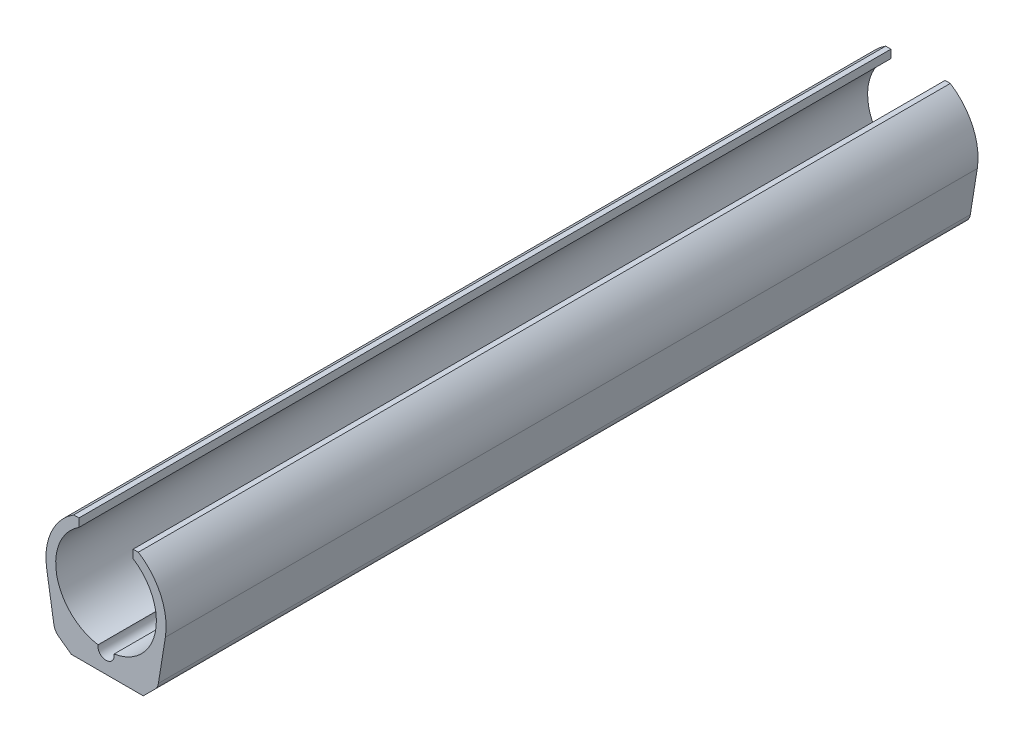
ISO-10303-21;
HEADER;
FILE_DESCRIPTION(('STEP AP214'),'2;1');
FILE_NAME('part.step','',(''),(''),'','','');
FILE_SCHEMA(('AUTOMOTIVE_DESIGN { 1 0 10303 214 1 1 1 1 }'));
ENDSEC;
DATA;
#1=APPLICATION_CONTEXT('core data for automotive mechanical design processes');
#2=APPLICATION_PROTOCOL_DEFINITION('international standard','automotive_design',2000,#1);
#3=PRODUCT_CONTEXT('',#1,'mechanical');
#4=PRODUCT('Part','Part','',(#3));
#5=PRODUCT_RELATED_PRODUCT_CATEGORY('part','',(#4));
#6=PRODUCT_DEFINITION_FORMATION('','',#4);
#7=PRODUCT_DEFINITION_CONTEXT('part definition',#1,'design');
#8=PRODUCT_DEFINITION('design','',#6,#7);
#9=PRODUCT_DEFINITION_SHAPE('','',#8);
#10=(LENGTH_UNIT() NAMED_UNIT(*) SI_UNIT(.MILLI.,.METRE.));
#11=(NAMED_UNIT(*) PLANE_ANGLE_UNIT() SI_UNIT($,.RADIAN.));
#12=(NAMED_UNIT(*) SI_UNIT($,.STERADIAN.) SOLID_ANGLE_UNIT());
#13=UNCERTAINTY_MEASURE_WITH_UNIT(LENGTH_MEASURE(1.E-05),#10,'distance_accuracy_value','');
#14=(GEOMETRIC_REPRESENTATION_CONTEXT(3) GLOBAL_UNCERTAINTY_ASSIGNED_CONTEXT((#13)) GLOBAL_UNIT_ASSIGNED_CONTEXT((#10,
#11,#12)) REPRESENTATION_CONTEXT('',''));
#15=CARTESIAN_POINT('',(0.,0.,0.));
#16=DIRECTION('',(0.,0.,1.));
#17=DIRECTION('',(1.,0.,0.));
#18=AXIS2_PLACEMENT_3D('',#15,#16,#17);
#19=CARTESIAN_POINT('',(0.,0.,200.));
#20=DIRECTION('',(0.,0.,-1.));
#21=DIRECTION('',(-1.,0.,0.));
#22=AXIS2_PLACEMENT_3D('',#19,#20,#21);
#23=CYLINDRICAL_SURFACE('',#22,14.8);
#24=CARTESIAN_POINT('',(0.,0.,0.));
#25=DIRECTION('',(0.,0.,1.));
#26=DIRECTION('',(1.,0.,0.));
#27=AXIS2_PLACEMENT_3D('',#24,#25,#26);
#28=CIRCLE('',#27,14.8);
#29=CARTESIAN_POINT('',(-7.96038271843621,12.4768708807947,0.));
#30=VERTEX_POINT('',#29);
#31=CARTESIAN_POINT('',(-14.6132639065058,-2.34361216902767,0.));
#32=VERTEX_POINT('',#31);
#33=EDGE_CURVE('E167',#30,#32,#28,.T.);
#34=ORIENTED_EDGE('',*,*,#33,.T.);
#35=DIRECTION('',(0.,0.,-1.));
#36=VECTOR('',#35,1.);
#37=CARTESIAN_POINT('',(-14.6132639065058,-2.34361216902767,200.));
#38=LINE('',#37,#36);
#39=CARTESIAN_POINT('',(-14.6132639065058,-2.34361216902767,200.));
#40=VERTEX_POINT('',#39);
#41=EDGE_CURVE('E151',#40,#32,#38,.T.);
#42=ORIENTED_EDGE('',*,*,#41,.F.);
#43=CARTESIAN_POINT('',(0.,0.,200.));
#44=DIRECTION('',(0.,0.,1.));
#45=DIRECTION('',(1.,0.,0.));
#46=AXIS2_PLACEMENT_3D('',#43,#44,#45);
#47=CIRCLE('',#46,14.8);
#48=CARTESIAN_POINT('',(-7.96038271843621,12.4768708807947,200.));
#49=VERTEX_POINT('',#48);
#50=EDGE_CURVE('E154',#49,#40,#47,.T.);
#51=ORIENTED_EDGE('',*,*,#50,.F.);
#52=DIRECTION('',(0.,0.,-1.));
#53=VECTOR('',#52,1.);
#54=CARTESIAN_POINT('',(-7.96038271843621,12.4768708807947,200.));
#55=LINE('',#54,#53);
#56=EDGE_CURVE('E247',#49,#30,#55,.T.);
#57=ORIENTED_EDGE('',*,*,#56,.T.);
#58=EDGE_LOOP('',(#34,#42,#51,#57));
#59=FACE_BOUND('',#58,.T.);
#60=ADVANCED_FACE('F35',(#59),#23,.T.);
#61=CARTESIAN_POINT('',(-14.6132639065058,-2.34361216902767,200.));
#62=DIRECTION('',(0.987382696385528,0.158352173582951,0.));
#63=DIRECTION('',(-0.158352173582951,0.987382696385528,0.));
#64=AXIS2_PLACEMENT_3D('',#61,#62,#63);
#65=PLANE('',#64);
#66=DIRECTION('',(0.158352173582951,-0.987382696385528,0.));
#67=VECTOR('',#66,1.);
#68=CARTESIAN_POINT('',(-14.6132639065058,-2.34361216902767,0.));
#69=LINE('',#68,#67);
#70=CARTESIAN_POINT('',(-12.8430114109721,-13.381772509831,0.));
#71=VERTEX_POINT('',#70);
#72=EDGE_CURVE('E249',#32,#71,#69,.T.);
#73=ORIENTED_EDGE('',*,*,#72,.T.);
#74=DIRECTION('',(0.,0.,-1.));
#75=VECTOR('',#74,1.);
#76=CARTESIAN_POINT('',(-12.8430114109721,-13.381772509831,200.));
#77=LINE('',#76,#75);
#78=CARTESIAN_POINT('',(-12.8430114109721,-13.381772509831,200.));
#79=VERTEX_POINT('',#78);
#80=EDGE_CURVE('E43',#71,#79,#77,.F.);
#81=ORIENTED_EDGE('',*,*,#80,.T.);
#82=DIRECTION('',(0.158352173582951,-0.987382696385528,0.));
#83=VECTOR('',#82,1.);
#84=CARTESIAN_POINT('',(-14.6132639065058,-2.34361216902767,200.));
#85=LINE('',#84,#83);
#86=EDGE_CURVE('E146',#40,#79,#85,.T.);
#87=ORIENTED_EDGE('',*,*,#86,.F.);
#88=ORIENTED_EDGE('',*,*,#41,.T.);
#89=EDGE_LOOP('',(#73,#81,#87,#88));
#90=FACE_BOUND('',#89,.T.);
#91=ADVANCED_FACE('F149',(#90),#65,.F.);
#92=CARTESIAN_POINT('',(-12.1711800364353,-17.5708825112737,200.));
#93=DIRECTION('',(0.,1.,0.));
#94=DIRECTION('',(0.,0.,1.));
#95=AXIS2_PLACEMENT_3D('',#92,#93,#94);
#96=PLANE('',#95);
#97=DIRECTION('',(1.,0.,0.));
#98=VECTOR('',#97,1.);
#99=CARTESIAN_POINT('',(-12.1711800364353,-17.5708825112737,0.));
#100=LINE('',#99,#98);
#101=CARTESIAN_POINT('',(-8.55249541930159,-17.5708825112737,0.));
#102=VERTEX_POINT('',#101);
#103=CARTESIAN_POINT('',(9.17118003643525,-17.5708825112737,0.));
#104=VERTEX_POINT('',#103);
#105=EDGE_CURVE('E230',#102,#104,#100,.T.);
#106=ORIENTED_EDGE('',*,*,#105,.T.);
#107=DIRECTION('',(0.,0.,1.));
#108=VECTOR('',#107,1.);
#109=CARTESIAN_POINT('',(9.17118003643525,-17.5708825112737,200.));
#110=LINE('',#109,#108);
#111=CARTESIAN_POINT('',(9.17118003643525,-17.5708825112737,200.));
#112=VERTEX_POINT('',#111);
#113=EDGE_CURVE('E183',#104,#112,#110,.T.);
#114=ORIENTED_EDGE('',*,*,#113,.T.);
#115=DIRECTION('',(1.,0.,0.));
#116=VECTOR('',#115,1.);
#117=CARTESIAN_POINT('',(-12.1711800364353,-17.5708825112737,200.));
#118=LINE('',#117,#116);
#119=CARTESIAN_POINT('',(-8.55249541930159,-17.5708825112737,200.));
#120=VERTEX_POINT('',#119);
#121=EDGE_CURVE('E153',#120,#112,#118,.T.);
#122=ORIENTED_EDGE('',*,*,#121,.F.);
#123=DIRECTION('',(0.,0.,-1.));
#124=VECTOR('',#123,1.);
#125=CARTESIAN_POINT('',(-8.55249541930159,-17.5708825112737,200.));
#126=LINE('',#125,#124);
#127=EDGE_CURVE('E180',#120,#102,#126,.T.);
#128=ORIENTED_EDGE('',*,*,#127,.T.);
#129=EDGE_LOOP('',(#106,#114,#122,#128));
#130=FACE_BOUND('',#129,.T.);
#131=ADVANCED_FACE('F228',(#130),#96,.F.);
#132=CARTESIAN_POINT('',(14.6132639065058,-2.34361216902767,200.));
#133=DIRECTION('',(-0.987382696385528,0.158352173582951,0.));
#134=DIRECTION('',(-0.158352173582951,-0.987382696385528,0.));
#135=AXIS2_PLACEMENT_3D('',#132,#133,#134);
#136=PLANE('',#135);
#137=DIRECTION('',(0.158352173582951,0.987382696385528,0.));
#138=VECTOR('',#137,1.);
#139=CARTESIAN_POINT('',(14.6132639065058,-2.34361216902767,200.));
#140=LINE('',#139,#138);
#141=CARTESIAN_POINT('',(12.8980520365405,-13.0385744339547,200.));
#142=VERTEX_POINT('',#141);
#143=CARTESIAN_POINT('',(14.6132639065058,-2.34361216902767,200.));
#144=VERTEX_POINT('',#143);
#145=EDGE_CURVE('E202',#142,#144,#140,.T.);
#146=ORIENTED_EDGE('',*,*,#145,.F.);
#147=DIRECTION('',(0.,0.,1.));
#148=VECTOR('',#147,1.);
#149=CARTESIAN_POINT('',(12.8980520365405,-13.0385744339547,0.));
#150=LINE('',#149,#148);
#151=CARTESIAN_POINT('',(12.8980520365405,-13.0385744339547,0.));
#152=VERTEX_POINT('',#151);
#153=EDGE_CURVE('E189',#142,#152,#150,.F.);
#154=ORIENTED_EDGE('',*,*,#153,.T.);
#155=DIRECTION('',(0.158352173582951,0.987382696385528,0.));
#156=VECTOR('',#155,1.);
#157=CARTESIAN_POINT('',(14.6132639065058,-2.34361216902767,0.));
#158=LINE('',#157,#156);
#159=CARTESIAN_POINT('',(14.6132639065058,-2.34361216902767,0.));
#160=VERTEX_POINT('',#159);
#161=EDGE_CURVE('E222',#152,#160,#158,.T.);
#162=ORIENTED_EDGE('',*,*,#161,.T.);
#163=DIRECTION('',(0.,0.,-1.));
#164=VECTOR('',#163,1.);
#165=CARTESIAN_POINT('',(14.6132639065058,-2.34361216902767,200.));
#166=LINE('',#165,#164);
#167=EDGE_CURVE('E169',#144,#160,#166,.T.);
#168=ORIENTED_EDGE('',*,*,#167,.F.);
#169=EDGE_LOOP('',(#146,#154,#162,#168));
#170=FACE_BOUND('',#169,.T.);
#171=ADVANCED_FACE('F210',(#170),#136,.F.);
#172=CARTESIAN_POINT('',(0.,0.,200.));
#173=DIRECTION('',(0.,0.,-1.));
#174=DIRECTION('',(-1.,0.,0.));
#175=AXIS2_PLACEMENT_3D('',#172,#173,#174);
#176=CYLINDRICAL_SURFACE('',#175,14.8);
#177=CARTESIAN_POINT('',(0.,0.,0.));
#178=DIRECTION('',(0.,0.,1.));
#179=DIRECTION('',(1.,0.,0.));
#180=AXIS2_PLACEMENT_3D('',#177,#178,#179);
#181=CIRCLE('',#180,14.8);
#182=CARTESIAN_POINT('',(7.96038271843621,12.4768708807947,0.));
#183=VERTEX_POINT('',#182);
#184=EDGE_CURVE('E253',#160,#183,#181,.T.);
#185=ORIENTED_EDGE('',*,*,#184,.T.);
#186=DIRECTION('',(0.,0.,-1.));
#187=VECTOR('',#186,1.);
#188=CARTESIAN_POINT('',(7.96038271843621,12.4768708807947,200.));
#189=LINE('',#188,#187);
#190=CARTESIAN_POINT('',(7.96038271843621,12.4768708807947,200.));
#191=VERTEX_POINT('',#190);
#192=EDGE_CURVE('E175',#191,#183,#189,.T.);
#193=ORIENTED_EDGE('',*,*,#192,.F.);
#194=CARTESIAN_POINT('',(0.,0.,200.));
#195=DIRECTION('',(0.,0.,1.));
#196=DIRECTION('',(1.,0.,0.));
#197=AXIS2_PLACEMENT_3D('',#194,#195,#196);
#198=CIRCLE('',#197,14.8);
#199=EDGE_CURVE('E213',#144,#191,#198,.T.);
#200=ORIENTED_EDGE('',*,*,#199,.F.);
#201=ORIENTED_EDGE('',*,*,#167,.T.);
#202=EDGE_LOOP('',(#185,#193,#200,#201));
#203=FACE_BOUND('',#202,.T.);
#204=ADVANCED_FACE('F307',(#203),#176,.T.);
#205=CARTESIAN_POINT('',(6.66950984517628,12.4768708807947,200.));
#206=DIRECTION('',(0.,-1.,0.));
#207=DIRECTION('',(1.,0.,0.));
#208=AXIS2_PLACEMENT_3D('',#205,#206,#207);
#209=PLANE('',#208);
#210=DIRECTION('',(-1.,0.,0.));
#211=VECTOR('',#210,1.);
#212=CARTESIAN_POINT('',(6.66950984517628,12.4768708807947,0.));
#213=LINE('',#212,#211);
#214=CARTESIAN_POINT('',(6.66950984517628,12.4768708807947,0.));
#215=VERTEX_POINT('',#214);
#216=EDGE_CURVE('E255',#183,#215,#213,.T.);
#217=ORIENTED_EDGE('',*,*,#216,.T.);
#218=DIRECTION('',(0.,0.,-1.));
#219=VECTOR('',#218,1.);
#220=CARTESIAN_POINT('',(6.66950984517628,12.4768708807947,200.));
#221=LINE('',#220,#219);
#222=CARTESIAN_POINT('',(6.66950984517628,12.4768708807947,200.));
#223=VERTEX_POINT('',#222);
#224=EDGE_CURVE('E284',#223,#215,#221,.T.);
#225=ORIENTED_EDGE('',*,*,#224,.F.);
#226=DIRECTION('',(-1.,0.,0.));
#227=VECTOR('',#226,1.);
#228=CARTESIAN_POINT('',(6.66950984517628,12.4768708807947,200.));
#229=LINE('',#228,#227);
#230=EDGE_CURVE('E234',#191,#223,#229,.T.);
#231=ORIENTED_EDGE('',*,*,#230,.F.);
#232=ORIENTED_EDGE('',*,*,#192,.T.);
#233=EDGE_LOOP('',(#217,#225,#231,#232));
#234=FACE_BOUND('',#233,.T.);
#235=ADVANCED_FACE('F291',(#234),#209,.F.);
#236=CARTESIAN_POINT('',(6.66950984517628,10.4535945217469,200.));
#237=DIRECTION('',(1.,0.,0.));
#238=DIRECTION('',(0.,0.,-1.));
#239=AXIS2_PLACEMENT_3D('',#236,#237,#238);
#240=PLANE('',#239);
#241=DIRECTION('',(0.,-1.,0.));
#242=VECTOR('',#241,1.);
#243=CARTESIAN_POINT('',(6.66950984517628,10.4535945217469,0.));
#244=LINE('',#243,#242);
#245=CARTESIAN_POINT('',(6.66950984517628,10.4535945217469,0.));
#246=VERTEX_POINT('',#245);
#247=EDGE_CURVE('E257',#215,#246,#244,.T.);
#248=ORIENTED_EDGE('',*,*,#247,.T.);
#249=DIRECTION('',(0.,0.,-1.));
#250=VECTOR('',#249,1.);
#251=CARTESIAN_POINT('',(6.66950984517628,10.4535945217469,200.));
#252=LINE('',#251,#250);
#253=CARTESIAN_POINT('',(6.66950984517628,10.4535945217469,200.));
#254=VERTEX_POINT('',#253);
#255=EDGE_CURVE('E281',#254,#246,#252,.T.);
#256=ORIENTED_EDGE('',*,*,#255,.F.);
#257=DIRECTION('',(0.,-1.,0.));
#258=VECTOR('',#257,1.);
#259=CARTESIAN_POINT('',(6.66950984517628,10.4535945217469,200.));
#260=LINE('',#259,#258);
#261=EDGE_CURVE('E236',#223,#254,#260,.T.);
#262=ORIENTED_EDGE('',*,*,#261,.F.);
#263=ORIENTED_EDGE('',*,*,#224,.T.);
#264=EDGE_LOOP('',(#248,#256,#262,#263));
#265=FACE_BOUND('',#264,.T.);
#266=ADVANCED_FACE('F299',(#265),#240,.F.);
#267=CARTESIAN_POINT('',(0.,0.,200.));
#268=DIRECTION('',(0.,0.,-1.));
#269=DIRECTION('',(-1.,0.,0.));
#270=AXIS2_PLACEMENT_3D('',#267,#268,#269);
#271=CYLINDRICAL_SURFACE('',#270,12.4);
#272=CARTESIAN_POINT('',(0.,0.,0.));
#273=DIRECTION('',(0.,0.,-1.));
#274=DIRECTION('',(1.,0.,0.));
#275=AXIS2_PLACEMENT_3D('',#272,#273,#274);
#276=CIRCLE('',#275,12.4);
#277=CARTESIAN_POINT('',(1.9727843626804,-12.242063627443,0.));
#278=VERTEX_POINT('',#277);
#279=EDGE_CURVE('E259',#246,#278,#276,.T.);
#280=ORIENTED_EDGE('',*,*,#279,.T.);
#281=DIRECTION('',(0.,0.,-1.));
#282=VECTOR('',#281,1.);
#283=CARTESIAN_POINT('',(1.9727843626804,-12.242063627443,200.));
#284=LINE('',#283,#282);
#285=CARTESIAN_POINT('',(1.9727843626804,-12.242063627443,200.));
#286=VERTEX_POINT('',#285);
#287=EDGE_CURVE('E278',#286,#278,#284,.T.);
#288=ORIENTED_EDGE('',*,*,#287,.F.);
#289=CARTESIAN_POINT('',(0.,0.,200.));
#290=DIRECTION('',(0.,0.,-1.));
#291=DIRECTION('',(1.,0.,0.));
#292=AXIS2_PLACEMENT_3D('',#289,#290,#291);
#293=CIRCLE('',#292,12.4);
#294=EDGE_CURVE('E238',#254,#286,#293,.T.);
#295=ORIENTED_EDGE('',*,*,#294,.F.);
#296=ORIENTED_EDGE('',*,*,#255,.T.);
#297=EDGE_LOOP('',(#280,#288,#295,#296));
#298=FACE_BOUND('',#297,.T.);
#299=ADVANCED_FACE('F303',(#298),#271,.F.);
#300=CARTESIAN_POINT('',(0.,-12.5708825112737,200.));
#301=DIRECTION('',(0.,0.,-1.));
#302=DIRECTION('',(-1.,0.,0.));
#303=AXIS2_PLACEMENT_3D('',#300,#301,#302);
#304=CYLINDRICAL_SURFACE('',#303,2.);
#305=CARTESIAN_POINT('',(0.,-12.5708825112737,0.));
#306=DIRECTION('',(0.,0.,-1.));
#307=DIRECTION('',(1.,0.,0.));
#308=AXIS2_PLACEMENT_3D('',#305,#306,#307);
#309=CIRCLE('',#308,2.);
#310=CARTESIAN_POINT('',(-1.97278436268041,-12.242063627443,0.));
#311=VERTEX_POINT('',#310);
#312=EDGE_CURVE('E261',#278,#311,#309,.T.);
#313=ORIENTED_EDGE('',*,*,#312,.T.);
#314=DIRECTION('',(0.,0.,-1.));
#315=VECTOR('',#314,1.);
#316=CARTESIAN_POINT('',(-1.97278436268041,-12.242063627443,200.));
#317=LINE('',#316,#315);
#318=CARTESIAN_POINT('',(-1.97278436268041,-12.242063627443,200.));
#319=VERTEX_POINT('',#318);
#320=EDGE_CURVE('E275',#319,#311,#317,.T.);
#321=ORIENTED_EDGE('',*,*,#320,.F.);
#322=CARTESIAN_POINT('',(0.,-12.5708825112737,200.));
#323=DIRECTION('',(0.,0.,-1.));
#324=DIRECTION('',(1.,0.,0.));
#325=AXIS2_PLACEMENT_3D('',#322,#323,#324);
#326=CIRCLE('',#325,2.);
#327=EDGE_CURVE('E240',#286,#319,#326,.T.);
#328=ORIENTED_EDGE('',*,*,#327,.F.);
#329=ORIENTED_EDGE('',*,*,#287,.T.);
#330=EDGE_LOOP('',(#313,#321,#328,#329));
#331=FACE_BOUND('',#330,.T.);
#332=ADVANCED_FACE('F356',(#331),#304,.F.);
#333=CARTESIAN_POINT('',(0.,0.,200.));
#334=DIRECTION('',(0.,0.,-1.));
#335=DIRECTION('',(-1.,0.,0.));
#336=AXIS2_PLACEMENT_3D('',#333,#334,#335);
#337=CYLINDRICAL_SURFACE('',#336,12.4);
#338=CARTESIAN_POINT('',(0.,0.,0.));
#339=DIRECTION('',(0.,0.,-1.));
#340=DIRECTION('',(1.,0.,0.));
#341=AXIS2_PLACEMENT_3D('',#338,#339,#340);
#342=CIRCLE('',#341,12.4);
#343=CARTESIAN_POINT('',(-6.66950984517628,10.4535945217469,0.));
#344=VERTEX_POINT('',#343);
#345=EDGE_CURVE('E263',#311,#344,#342,.T.);
#346=ORIENTED_EDGE('',*,*,#345,.T.);
#347=DIRECTION('',(0.,0.,-1.));
#348=VECTOR('',#347,1.);
#349=CARTESIAN_POINT('',(-6.66950984517628,10.4535945217469,200.));
#350=LINE('',#349,#348);
#351=CARTESIAN_POINT('',(-6.66950984517628,10.4535945217469,200.));
#352=VERTEX_POINT('',#351);
#353=EDGE_CURVE('E272',#352,#344,#350,.T.);
#354=ORIENTED_EDGE('',*,*,#353,.F.);
#355=CARTESIAN_POINT('',(0.,0.,200.));
#356=DIRECTION('',(0.,0.,-1.));
#357=DIRECTION('',(1.,0.,0.));
#358=AXIS2_PLACEMENT_3D('',#355,#356,#357);
#359=CIRCLE('',#358,12.4);
#360=EDGE_CURVE('E242',#319,#352,#359,.T.);
#361=ORIENTED_EDGE('',*,*,#360,.F.);
#362=ORIENTED_EDGE('',*,*,#320,.T.);
#363=EDGE_LOOP('',(#346,#354,#361,#362));
#364=FACE_BOUND('',#363,.T.);
#365=ADVANCED_FACE('F354',(#364),#337,.F.);
#366=CARTESIAN_POINT('',(-6.66950984517628,10.4535945217469,200.));
#367=DIRECTION('',(-1.,0.,0.));
#368=DIRECTION('',(0.,0.,1.));
#369=AXIS2_PLACEMENT_3D('',#366,#367,#368);
#370=PLANE('',#369);
#371=DIRECTION('',(0.,1.,0.));
#372=VECTOR('',#371,1.);
#373=CARTESIAN_POINT('',(-6.66950984517628,10.4535945217469,0.));
#374=LINE('',#373,#372);
#375=CARTESIAN_POINT('',(-6.66950984517628,12.4768708807947,0.));
#376=VERTEX_POINT('',#375);
#377=EDGE_CURVE('E265',#344,#376,#374,.T.);
#378=ORIENTED_EDGE('',*,*,#377,.T.);
#379=DIRECTION('',(0.,0.,-1.));
#380=VECTOR('',#379,1.);
#381=CARTESIAN_POINT('',(-6.66950984517628,12.4768708807947,200.));
#382=LINE('',#381,#380);
#383=CARTESIAN_POINT('',(-6.66950984517628,12.4768708807947,200.));
#384=VERTEX_POINT('',#383);
#385=EDGE_CURVE('E269',#384,#376,#382,.T.);
#386=ORIENTED_EDGE('',*,*,#385,.F.);
#387=DIRECTION('',(0.,1.,0.));
#388=VECTOR('',#387,1.);
#389=CARTESIAN_POINT('',(-6.66950984517628,10.4535945217469,200.));
#390=LINE('',#389,#388);
#391=EDGE_CURVE('E244',#352,#384,#390,.T.);
#392=ORIENTED_EDGE('',*,*,#391,.F.);
#393=ORIENTED_EDGE('',*,*,#353,.T.);
#394=EDGE_LOOP('',(#378,#386,#392,#393));
#395=FACE_BOUND('',#394,.T.);
#396=ADVANCED_FACE('F350',(#395),#370,.F.);
#397=CARTESIAN_POINT('',(-6.66950984517628,12.4768708807947,200.));
#398=DIRECTION('',(0.,-1.,0.));
#399=DIRECTION('',(1.,0.,0.));
#400=AXIS2_PLACEMENT_3D('',#397,#398,#399);
#401=PLANE('',#400);
#402=DIRECTION('',(-1.,0.,0.));
#403=VECTOR('',#402,1.);
#404=CARTESIAN_POINT('',(-6.66950984517628,12.4768708807947,0.));
#405=LINE('',#404,#403);
#406=EDGE_CURVE('E164',#376,#30,#405,.T.);
#407=ORIENTED_EDGE('',*,*,#406,.T.);
#408=ORIENTED_EDGE('',*,*,#56,.F.);
#409=DIRECTION('',(-1.,0.,0.));
#410=VECTOR('',#409,1.);
#411=CARTESIAN_POINT('',(-6.66950984517628,12.4768708807947,200.));
#412=LINE('',#411,#410);
#413=EDGE_CURVE('E160',#384,#49,#412,.T.);
#414=ORIENTED_EDGE('',*,*,#413,.F.);
#415=ORIENTED_EDGE('',*,*,#385,.T.);
#416=EDGE_LOOP('',(#407,#408,#414,#415));
#417=FACE_BOUND('',#416,.T.);
#418=ADVANCED_FACE('F346',(#417),#401,.F.);
#419=CARTESIAN_POINT('',(0.,0.,200.));
#420=DIRECTION('',(0.,0.,1.));
#421=DIRECTION('',(1.,0.,0.));
#422=AXIS2_PLACEMENT_3D('',#419,#420,#421);
#423=PLANE('',#422);
#424=DIRECTION('',(-0.70710678118655,-0.707106781186545,0.));
#425=VECTOR('',#424,1.);
#426=CARTESIAN_POINT('',(13.3710312738545,-13.3710312738546,200.));
#427=LINE('',#426,#425);
#428=CARTESIAN_POINT('',(12.0572242909435,-14.6848382567655,200.));
#429=VERTEX_POINT('',#428);
#430=EDGE_CURVE('E187',#112,#429,#427,.F.);
#431=ORIENTED_EDGE('',*,*,#430,.T.);
#432=CARTESIAN_POINT('',(9.9359039473839,-12.5635179132058,200.));
#433=DIRECTION('',(0.,0.,1.));
#434=DIRECTION('',(1.,0.,0.));
#435=AXIS2_PLACEMENT_3D('',#432,#433,#434);
#436=CIRCLE('',#435,3.);
#437=EDGE_CURVE('E199',#429,#142,#436,.T.);
#438=ORIENTED_EDGE('',*,*,#437,.T.);
#439=ORIENTED_EDGE('',*,*,#145,.T.);
#440=ORIENTED_EDGE('',*,*,#199,.T.);
#441=ORIENTED_EDGE('',*,*,#230,.T.);
#442=ORIENTED_EDGE('',*,*,#261,.T.);
#443=ORIENTED_EDGE('',*,*,#294,.T.);
#444=ORIENTED_EDGE('',*,*,#327,.T.);
#445=ORIENTED_EDGE('',*,*,#360,.T.);
#446=ORIENTED_EDGE('',*,*,#391,.T.);
#447=ORIENTED_EDGE('',*,*,#413,.T.);
#448=ORIENTED_EDGE('',*,*,#50,.T.);
#449=ORIENTED_EDGE('',*,*,#86,.T.);
#450=CARTESIAN_POINT('',(-9.88086332181548,-12.9067159890821,200.));
#451=DIRECTION('',(0.,0.,1.));
#452=DIRECTION('',(1.,0.,0.));
#453=AXIS2_PLACEMENT_3D('',#450,#451,#452);
#454=CIRCLE('',#453,3.);
#455=CARTESIAN_POINT('',(-11.6395026352685,-15.3371866770719,200.));
#456=VERTEX_POINT('',#455);
#457=EDGE_CURVE('E50',#79,#456,#454,.T.);
#458=ORIENTED_EDGE('',*,*,#457,.T.);
#459=DIRECTION('',(-0.810156895996596,0.586213104484334,0.));
#460=VECTOR('',#459,1.);
#461=CARTESIAN_POINT('',(-11.283873320623,-15.5945128389723,200.));
#462=LINE('',#461,#460);
#463=EDGE_CURVE('E185',#456,#120,#462,.F.);
#464=ORIENTED_EDGE('',*,*,#463,.T.);
#465=ORIENTED_EDGE('',*,*,#121,.T.);
#466=EDGE_LOOP('',(#431,#438,#439,#440,#441,#442,#443,#444,#445,#446,#447,#448,#449,#458,#464,#465));
#467=FACE_BOUND('',#466,.T.);
#468=ADVANCED_FACE('F158',(#467),#423,.T.);
#469=CARTESIAN_POINT('',(0.,0.,0.));
#470=DIRECTION('',(0.,0.,1.));
#471=DIRECTION('',(1.,0.,0.));
#472=AXIS2_PLACEMENT_3D('',#469,#470,#471);
#473=PLANE('',#472);
#474=ORIENTED_EDGE('',*,*,#161,.F.);
#475=CARTESIAN_POINT('',(9.9359039473839,-12.5635179132058,0.));
#476=DIRECTION('',(0.,0.,1.));
#477=DIRECTION('',(1.,0.,0.));
#478=AXIS2_PLACEMENT_3D('',#475,#476,#477);
#479=CIRCLE('',#478,3.);
#480=CARTESIAN_POINT('',(12.0572242909435,-14.6848382567655,0.));
#481=VERTEX_POINT('',#480);
#482=EDGE_CURVE('E194',#152,#481,#479,.F.);
#483=ORIENTED_EDGE('',*,*,#482,.T.);
#484=DIRECTION('',(0.70710678118655,0.707106781186545,0.));
#485=VECTOR('',#484,1.);
#486=CARTESIAN_POINT('',(12.7442066110696,-13.9978559366394,0.));
#487=LINE('',#486,#485);
#488=EDGE_CURVE('E172',#481,#104,#487,.F.);
#489=ORIENTED_EDGE('',*,*,#488,.T.);
#490=ORIENTED_EDGE('',*,*,#105,.F.);
#491=DIRECTION('',(0.810156895996596,-0.586213104484334,0.));
#492=VECTOR('',#491,1.);
#493=CARTESIAN_POINT('',(-8.55249541930159,-17.5708825112737,0.));
#494=LINE('',#493,#492);
#495=CARTESIAN_POINT('',(-11.6395026352685,-15.3371866770719,0.));
#496=VERTEX_POINT('',#495);
#497=EDGE_CURVE('E168',#102,#496,#494,.F.);
#498=ORIENTED_EDGE('',*,*,#497,.T.);
#499=CARTESIAN_POINT('',(-9.88086332181548,-12.9067159890821,0.));
#500=DIRECTION('',(0.,0.,1.));
#501=DIRECTION('',(1.,0.,0.));
#502=AXIS2_PLACEMENT_3D('',#499,#500,#501);
#503=CIRCLE('',#502,3.);
#504=EDGE_CURVE('E192',#496,#71,#503,.F.);
#505=ORIENTED_EDGE('',*,*,#504,.T.);
#506=ORIENTED_EDGE('',*,*,#72,.F.);
#507=ORIENTED_EDGE('',*,*,#33,.F.);
#508=ORIENTED_EDGE('',*,*,#406,.F.);
#509=ORIENTED_EDGE('',*,*,#377,.F.);
#510=ORIENTED_EDGE('',*,*,#345,.F.);
#511=ORIENTED_EDGE('',*,*,#312,.F.);
#512=ORIENTED_EDGE('',*,*,#279,.F.);
#513=ORIENTED_EDGE('',*,*,#247,.F.);
#514=ORIENTED_EDGE('',*,*,#216,.F.);
#515=ORIENTED_EDGE('',*,*,#184,.F.);
#516=EDGE_LOOP('',(#474,#483,#489,#490,#498,#505,#506,#507,#508,#509,#510,#511,#512,#513,#514,#515));
#517=FACE_BOUND('',#516,.T.);
#518=ADVANCED_FACE('F218',(#517),#473,.F.);
#519=CARTESIAN_POINT('',(12.7442066110696,-13.9978559366394,200.));
#520=DIRECTION('',(-0.707106781186545,0.70710678118655,0.));
#521=DIRECTION('',(0.,0.,-1.));
#522=AXIS2_PLACEMENT_3D('',#519,#520,#521);
#523=PLANE('',#522);
#524=ORIENTED_EDGE('',*,*,#488,.F.);
#525=DIRECTION('',(0.,0.,-1.));
#526=VECTOR('',#525,1.);
#527=CARTESIAN_POINT('',(12.0572242909435,-14.6848382567655,200.));
#528=LINE('',#527,#526);
#529=EDGE_CURVE('E196',#481,#429,#528,.F.);
#530=ORIENTED_EDGE('',*,*,#529,.T.);
#531=ORIENTED_EDGE('',*,*,#430,.F.);
#532=ORIENTED_EDGE('',*,*,#113,.F.);
#533=EDGE_LOOP('',(#524,#530,#531,#532));
#534=FACE_BOUND('',#533,.T.);
#535=ADVANCED_FACE('F225',(#534),#523,.F.);
#536=CARTESIAN_POINT('',(-8.55249541930159,-17.5708825112737,200.));
#537=DIRECTION('',(0.586213104484334,0.810156895996596,0.));
#538=DIRECTION('',(0.,0.,-1.));
#539=AXIS2_PLACEMENT_3D('',#536,#537,#538);
#540=PLANE('',#539);
#541=ORIENTED_EDGE('',*,*,#463,.F.);
#542=DIRECTION('',(0.,0.,1.));
#543=VECTOR('',#542,1.);
#544=CARTESIAN_POINT('',(-11.6395026352685,-15.3371866770719,0.));
#545=LINE('',#544,#543);
#546=EDGE_CURVE('E11',#456,#496,#545,.F.);
#547=ORIENTED_EDGE('',*,*,#546,.T.);
#548=ORIENTED_EDGE('',*,*,#497,.F.);
#549=ORIENTED_EDGE('',*,*,#127,.F.);
#550=EDGE_LOOP('',(#541,#547,#548,#549));
#551=FACE_BOUND('',#550,.T.);
#552=ADVANCED_FACE('F330',(#551),#540,.F.);
#553=CARTESIAN_POINT('',(9.9359039473839,-12.5635179132058,200.));
#554=DIRECTION('',(0.,0.,-1.));
#555=DIRECTION('',(-1.,0.,0.));
#556=AXIS2_PLACEMENT_3D('',#553,#554,#555);
#557=CYLINDRICAL_SURFACE('',#556,3.);
#558=ORIENTED_EDGE('',*,*,#437,.F.);
#559=ORIENTED_EDGE('',*,*,#529,.F.);
#560=ORIENTED_EDGE('',*,*,#482,.F.);
#561=ORIENTED_EDGE('',*,*,#153,.F.);
#562=EDGE_LOOP('',(#558,#559,#560,#561));
#563=FACE_BOUND('',#562,.T.);
#564=ADVANCED_FACE('F215',(#563),#557,.T.);
#565=CARTESIAN_POINT('',(-9.88086332181548,-12.9067159890821,200.));
#566=DIRECTION('',(0.,0.,1.));
#567=DIRECTION('',(1.,0.,0.));
#568=AXIS2_PLACEMENT_3D('',#565,#566,#567);
#569=CYLINDRICAL_SURFACE('',#568,3.);
#570=ORIENTED_EDGE('',*,*,#504,.F.);
#571=ORIENTED_EDGE('',*,*,#546,.F.);
#572=ORIENTED_EDGE('',*,*,#457,.F.);
#573=ORIENTED_EDGE('',*,*,#80,.F.);
#574=EDGE_LOOP('',(#570,#571,#572,#573));
#575=FACE_BOUND('',#574,.T.);
#576=ADVANCED_FACE('F37',(#575),#569,.T.);
#577=CLOSED_SHELL('',(#60,#91,#131,#171,#204,#235,#266,#299,#332,#365,#396,#418,#468,#518,#535,
#552,#564,#576));
#578=MANIFOLD_SOLID_BREP('B2',#577);
#579=ADVANCED_BREP_SHAPE_REPRESENTATION('',(#18,#578),#14);
#580=SHAPE_DEFINITION_REPRESENTATION(#9,#579);
ENDSEC;
END-ISO-10303-21;
